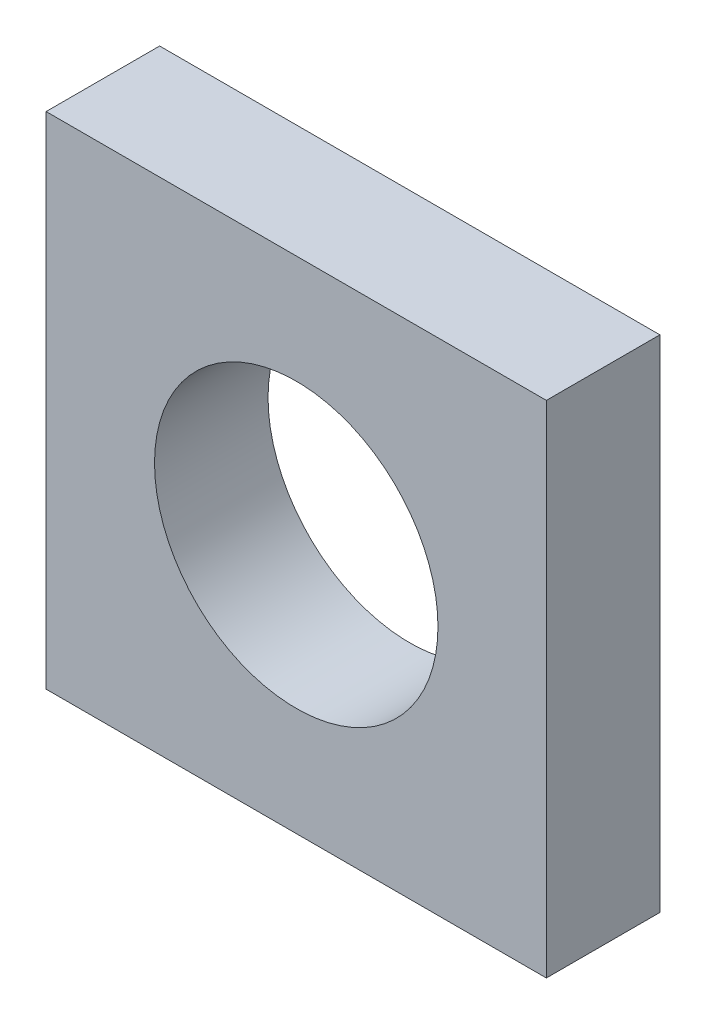
ISO-10303-21;
HEADER;
FILE_DESCRIPTION(('STEP AP214'),'2;1');
FILE_NAME('part.step','',(''),(''),'','','');
FILE_SCHEMA(('AUTOMOTIVE_DESIGN { 1 0 10303 214 1 1 1 1 }'));
ENDSEC;
DATA;
#1=APPLICATION_CONTEXT('core data for automotive mechanical design processes');
#2=APPLICATION_PROTOCOL_DEFINITION('international standard','automotive_design',2000,#1);
#3=PRODUCT_CONTEXT('',#1,'mechanical');
#4=PRODUCT('Part','Part','',(#3));
#5=PRODUCT_RELATED_PRODUCT_CATEGORY('part','',(#4));
#6=PRODUCT_DEFINITION_FORMATION('','',#4);
#7=PRODUCT_DEFINITION_CONTEXT('part definition',#1,'design');
#8=PRODUCT_DEFINITION('design','',#6,#7);
#9=PRODUCT_DEFINITION_SHAPE('','',#8);
#10=(LENGTH_UNIT() NAMED_UNIT(*) SI_UNIT(.MILLI.,.METRE.));
#11=(NAMED_UNIT(*) PLANE_ANGLE_UNIT() SI_UNIT($,.RADIAN.));
#12=(NAMED_UNIT(*) SI_UNIT($,.STERADIAN.) SOLID_ANGLE_UNIT());
#13=UNCERTAINTY_MEASURE_WITH_UNIT(LENGTH_MEASURE(1.E-05),#10,'distance_accuracy_value','');
#14=(GEOMETRIC_REPRESENTATION_CONTEXT(3) GLOBAL_UNCERTAINTY_ASSIGNED_CONTEXT((#13)) GLOBAL_UNIT_ASSIGNED_CONTEXT((#10,
#11,#12)) REPRESENTATION_CONTEXT('',''));
#15=CARTESIAN_POINT('',(0.,0.,0.));
#16=DIRECTION('',(0.,0.,1.));
#17=DIRECTION('',(1.,0.,0.));
#18=AXIS2_PLACEMENT_3D('',#15,#16,#17);
#19=CARTESIAN_POINT('',(0.,0.,-10.73));
#20=DIRECTION('',(0.,0.,-1.));
#21=DIRECTION('',(-1.,0.,0.));
#22=AXIS2_PLACEMENT_3D('',#19,#20,#21);
#23=PLANE('',#22);
#24=CARTESIAN_POINT('',(-12.5,0.,-10.73));
#25=DIRECTION('',(0.,0.,-1.));
#26=DIRECTION('',(-1.,0.,0.));
#27=AXIS2_PLACEMENT_3D('',#24,#25,#26);
#28=CIRCLE('',#27,1.4732);
#29=CARTESIAN_POINT('',(-13.9732,0.,-10.73));
#30=VERTEX_POINT('',#29);
#31=EDGE_CURVE('E20',#30,#30,#28,.F.);
#32=ORIENTED_EDGE('',*,*,#31,.T.);
#33=EDGE_LOOP('',(#32));
#34=FACE_BOUND('',#33,.T.);
#35=DIRECTION('',(0.,1.,0.));
#36=VECTOR('',#35,1.);
#37=CARTESIAN_POINT('',(-15.1,-2.6,-10.73));
#38=LINE('',#37,#36);
#39=CARTESIAN_POINT('',(-15.1,2.6,-10.73));
#40=VERTEX_POINT('',#39);
#41=CARTESIAN_POINT('',(-15.1,-2.6,-10.73));
#42=VERTEX_POINT('',#41);
#43=EDGE_CURVE('E70',#40,#42,#38,.F.);
#44=ORIENTED_EDGE('',*,*,#43,.F.);
#45=DIRECTION('',(1.,0.,0.));
#46=VECTOR('',#45,1.);
#47=CARTESIAN_POINT('',(-15.1,2.6,-10.73));
#48=LINE('',#47,#46);
#49=CARTESIAN_POINT('',(-9.9,2.6,-10.73));
#50=VERTEX_POINT('',#49);
#51=EDGE_CURVE('E67',#50,#40,#48,.F.);
#52=ORIENTED_EDGE('',*,*,#51,.F.);
#53=DIRECTION('',(0.,1.,0.));
#54=VECTOR('',#53,1.);
#55=CARTESIAN_POINT('',(-9.9,2.6,-10.73));
#56=LINE('',#55,#54);
#57=CARTESIAN_POINT('',(-9.9,-2.6,-10.73));
#58=VERTEX_POINT('',#57);
#59=EDGE_CURVE('E58',#58,#50,#56,.T.);
#60=ORIENTED_EDGE('',*,*,#59,.F.);
#61=DIRECTION('',(1.,0.,0.));
#62=VECTOR('',#61,1.);
#63=CARTESIAN_POINT('',(-9.9,-2.6,-10.73));
#64=LINE('',#63,#62);
#65=EDGE_CURVE('E53',#42,#58,#64,.T.);
#66=ORIENTED_EDGE('',*,*,#65,.F.);
#67=EDGE_LOOP('',(#44,#52,#60,#66));
#68=FACE_BOUND('',#67,.T.);
#69=ADVANCED_FACE('F17',(#34,#68),#23,.T.);
#70=CARTESIAN_POINT('',(-15.1,2.6,-9.55));
#71=DIRECTION('',(0.,1.,0.));
#72=DIRECTION('',(0.,0.,1.));
#73=AXIS2_PLACEMENT_3D('',#70,#71,#72);
#74=PLANE('',#73);
#75=DIRECTION('',(0.,0.,1.));
#76=VECTOR('',#75,1.);
#77=CARTESIAN_POINT('',(-15.1,2.6,-9.55));
#78=LINE('',#77,#76);
#79=CARTESIAN_POINT('',(-15.1,2.6,-9.55));
#80=VERTEX_POINT('',#79);
#81=EDGE_CURVE('E82',#80,#40,#78,.F.);
#82=ORIENTED_EDGE('',*,*,#81,.F.);
#83=DIRECTION('',(-1.,0.,0.));
#84=VECTOR('',#83,1.);
#85=CARTESIAN_POINT('',(0.,2.6,-9.55));
#86=LINE('',#85,#84);
#87=CARTESIAN_POINT('',(-9.9,2.6,-9.55));
#88=VERTEX_POINT('',#87);
#89=EDGE_CURVE('E77',#80,#88,#86,.F.);
#90=ORIENTED_EDGE('',*,*,#89,.T.);
#91=DIRECTION('',(0.,0.,-1.));
#92=VECTOR('',#91,1.);
#93=CARTESIAN_POINT('',(-9.9,2.6,-9.55));
#94=LINE('',#93,#92);
#95=EDGE_CURVE('E63',#50,#88,#94,.F.);
#96=ORIENTED_EDGE('',*,*,#95,.F.);
#97=ORIENTED_EDGE('',*,*,#51,.T.);
#98=EDGE_LOOP('',(#82,#90,#96,#97));
#99=FACE_BOUND('',#98,.T.);
#100=ADVANCED_FACE('F76',(#99),#74,.T.);
#101=CARTESIAN_POINT('',(-9.9,2.6,-9.55));
#102=DIRECTION('',(1.,0.,0.));
#103=DIRECTION('',(0.,0.,-1.));
#104=AXIS2_PLACEMENT_3D('',#101,#102,#103);
#105=PLANE('',#104);
#106=ORIENTED_EDGE('',*,*,#95,.T.);
#107=DIRECTION('',(0.,1.,0.));
#108=VECTOR('',#107,1.);
#109=CARTESIAN_POINT('',(-9.9,0.,-9.55));
#110=LINE('',#109,#108);
#111=CARTESIAN_POINT('',(-9.9,-2.6,-9.55));
#112=VERTEX_POINT('',#111);
#113=EDGE_CURVE('E87',#88,#112,#110,.F.);
#114=ORIENTED_EDGE('',*,*,#113,.T.);
#115=DIRECTION('',(0.,0.,-1.));
#116=VECTOR('',#115,1.);
#117=CARTESIAN_POINT('',(-9.9,-2.6,-9.55));
#118=LINE('',#117,#116);
#119=EDGE_CURVE('E65',#58,#112,#118,.F.);
#120=ORIENTED_EDGE('',*,*,#119,.F.);
#121=ORIENTED_EDGE('',*,*,#59,.T.);
#122=EDGE_LOOP('',(#106,#114,#120,#121));
#123=FACE_BOUND('',#122,.T.);
#124=ADVANCED_FACE('F60',(#123),#105,.T.);
#125=CARTESIAN_POINT('',(-9.9,-2.6,-9.55));
#126=DIRECTION('',(0.,-1.,0.));
#127=DIRECTION('',(0.,0.,-1.));
#128=AXIS2_PLACEMENT_3D('',#125,#126,#127);
#129=PLANE('',#128);
#130=ORIENTED_EDGE('',*,*,#119,.T.);
#131=DIRECTION('',(-1.,0.,0.));
#132=VECTOR('',#131,1.);
#133=CARTESIAN_POINT('',(0.,-2.6,-9.55));
#134=LINE('',#133,#132);
#135=CARTESIAN_POINT('',(-15.1,-2.6,-9.55));
#136=VERTEX_POINT('',#135);
#137=EDGE_CURVE('E89',#112,#136,#134,.T.);
#138=ORIENTED_EDGE('',*,*,#137,.T.);
#139=DIRECTION('',(0.,0.,1.));
#140=VECTOR('',#139,1.);
#141=CARTESIAN_POINT('',(-15.1,-2.6,-9.55));
#142=LINE('',#141,#140);
#143=EDGE_CURVE('E34',#42,#136,#142,.T.);
#144=ORIENTED_EDGE('',*,*,#143,.F.);
#145=ORIENTED_EDGE('',*,*,#65,.T.);
#146=EDGE_LOOP('',(#130,#138,#144,#145));
#147=FACE_BOUND('',#146,.T.);
#148=ADVANCED_FACE('F96',(#147),#129,.T.);
#149=CARTESIAN_POINT('',(-15.1,-2.6,-9.55));
#150=DIRECTION('',(-1.,0.,0.));
#151=DIRECTION('',(0.,0.,1.));
#152=AXIS2_PLACEMENT_3D('',#149,#150,#151);
#153=PLANE('',#152);
#154=ORIENTED_EDGE('',*,*,#143,.T.);
#155=DIRECTION('',(0.,1.,0.));
#156=VECTOR('',#155,1.);
#157=CARTESIAN_POINT('',(-15.1,0.,-9.55));
#158=LINE('',#157,#156);
#159=EDGE_CURVE('E26',#136,#80,#158,.T.);
#160=ORIENTED_EDGE('',*,*,#159,.T.);
#161=ORIENTED_EDGE('',*,*,#81,.T.);
#162=ORIENTED_EDGE('',*,*,#43,.T.);
#163=EDGE_LOOP('',(#154,#160,#161,#162));
#164=FACE_BOUND('',#163,.T.);
#165=ADVANCED_FACE('F92',(#164),#153,.T.);
#166=CARTESIAN_POINT('',(-12.5,0.,-9.55));
#167=DIRECTION('',(0.,0.,-1.));
#168=DIRECTION('',(-1.,0.,0.));
#169=AXIS2_PLACEMENT_3D('',#166,#167,#168);
#170=CYLINDRICAL_SURFACE('',#169,1.4732);
#171=ORIENTED_EDGE('',*,*,#31,.F.);
#172=EDGE_LOOP('',(#171));
#173=FACE_BOUND('',#172,.T.);
#174=CARTESIAN_POINT('',(-12.5,0.,-9.55));
#175=DIRECTION('',(0.,0.,-1.));
#176=DIRECTION('',(-1.,0.,0.));
#177=AXIS2_PLACEMENT_3D('',#174,#175,#176);
#178=CIRCLE('',#177,1.4732);
#179=CARTESIAN_POINT('',(-13.9732,0.,-9.55));
#180=VERTEX_POINT('',#179);
#181=EDGE_CURVE('E11',#180,#180,#178,.F.);
#182=ORIENTED_EDGE('',*,*,#181,.T.);
#183=EDGE_LOOP('',(#182));
#184=FACE_BOUND('',#183,.T.);
#185=ADVANCED_FACE('F104',(#173,#184),#170,.F.);
#186=CARTESIAN_POINT('',(0.,0.,-9.55));
#187=DIRECTION('',(0.,0.,-1.));
#188=DIRECTION('',(-1.,0.,0.));
#189=AXIS2_PLACEMENT_3D('',#186,#187,#188);
#190=PLANE('',#189);
#191=ORIENTED_EDGE('',*,*,#181,.F.);
#192=EDGE_LOOP('',(#191));
#193=FACE_BOUND('',#192,.T.);
#194=ORIENTED_EDGE('',*,*,#137,.F.);
#195=ORIENTED_EDGE('',*,*,#113,.F.);
#196=ORIENTED_EDGE('',*,*,#89,.F.);
#197=ORIENTED_EDGE('',*,*,#159,.F.);
#198=EDGE_LOOP('',(#194,#195,#196,#197));
#199=FACE_BOUND('',#198,.T.);
#200=ADVANCED_FACE('F95',(#193,#199),#190,.F.);
#201=CLOSED_SHELL('',(#69,#100,#124,#148,#165,#185,#200));
#202=MANIFOLD_SOLID_BREP('B1',#201);
#203=ADVANCED_BREP_SHAPE_REPRESENTATION('',(#18,#202),#14);
#204=SHAPE_DEFINITION_REPRESENTATION(#9,#203);
ENDSEC;
END-ISO-10303-21;
